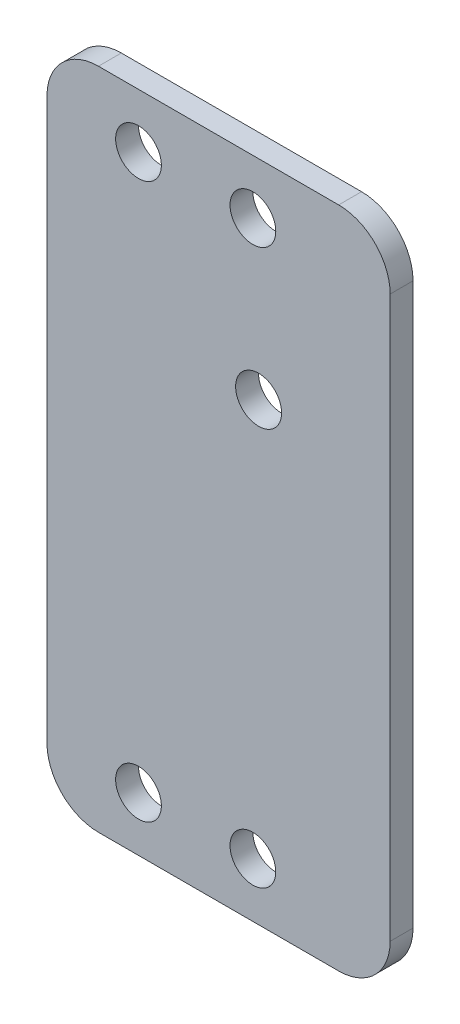
ISO-10303-21;
HEADER;
FILE_DESCRIPTION(('STEP AP214'),'2;1');
FILE_NAME('part.step','',(''),(''),'','','');
FILE_SCHEMA(('AUTOMOTIVE_DESIGN { 1 0 10303 214 1 1 1 1 }'));
ENDSEC;
DATA;
#1=APPLICATION_CONTEXT('core data for automotive mechanical design processes');
#2=APPLICATION_PROTOCOL_DEFINITION('international standard','automotive_design',2000,#1);
#3=PRODUCT_CONTEXT('',#1,'mechanical');
#4=PRODUCT('Part','Part','',(#3));
#5=PRODUCT_RELATED_PRODUCT_CATEGORY('part','',(#4));
#6=PRODUCT_DEFINITION_FORMATION('','',#4);
#7=PRODUCT_DEFINITION_CONTEXT('part definition',#1,'design');
#8=PRODUCT_DEFINITION('design','',#6,#7);
#9=PRODUCT_DEFINITION_SHAPE('','',#8);
#10=(LENGTH_UNIT() NAMED_UNIT(*) SI_UNIT(.MILLI.,.METRE.));
#11=(NAMED_UNIT(*) PLANE_ANGLE_UNIT() SI_UNIT($,.RADIAN.));
#12=(NAMED_UNIT(*) SI_UNIT($,.STERADIAN.) SOLID_ANGLE_UNIT());
#13=UNCERTAINTY_MEASURE_WITH_UNIT(LENGTH_MEASURE(1.E-05),#10,'distance_accuracy_value','');
#14=(GEOMETRIC_REPRESENTATION_CONTEXT(3) GLOBAL_UNCERTAINTY_ASSIGNED_CONTEXT((#13)) GLOBAL_UNIT_ASSIGNED_CONTEXT((#10,
#11,#12)) REPRESENTATION_CONTEXT('',''));
#15=CARTESIAN_POINT('',(0.,0.,0.));
#16=DIRECTION('',(0.,0.,1.));
#17=DIRECTION('',(1.,0.,0.));
#18=AXIS2_PLACEMENT_3D('',#15,#16,#17);
#19=CARTESIAN_POINT('',(0.,0.,-2.));
#20=DIRECTION('',(0.,0.,-1.));
#21=DIRECTION('',(1.,0.,0.));
#22=AXIS2_PLACEMENT_3D('',#19,#20,#21);
#23=PLANE('',#22);
#24=CARTESIAN_POINT('',(3.,-24.25,-2.));
#25=DIRECTION('',(0.,0.,1.));
#26=DIRECTION('',(1.,0.,0.));
#27=AXIS2_PLACEMENT_3D('',#24,#25,#26);
#28=CIRCLE('',#27,2.);
#29=CARTESIAN_POINT('',(5.,-24.25,-2.));
#30=VERTEX_POINT('',#29);
#31=EDGE_CURVE('E196',#30,#30,#28,.T.);
#32=ORIENTED_EDGE('',*,*,#31,.T.);
#33=EDGE_LOOP('',(#32));
#34=FACE_BOUND('',#33,.T.);
#35=CARTESIAN_POINT('',(-7.00000000000001,24.25,-2.));
#36=DIRECTION('',(0.,0.,1.));
#37=DIRECTION('',(1.,0.,0.));
#38=AXIS2_PLACEMENT_3D('',#35,#36,#37);
#39=CIRCLE('',#38,2.);
#40=CARTESIAN_POINT('',(-5.00000000000001,24.25,-2.));
#41=VERTEX_POINT('',#40);
#42=EDGE_CURVE('E185',#41,#41,#39,.T.);
#43=ORIENTED_EDGE('',*,*,#42,.T.);
#44=EDGE_LOOP('',(#43));
#45=FACE_BOUND('',#44,.T.);
#46=DIRECTION('',(1.,0.,0.));
#47=VECTOR('',#46,1.);
#48=CARTESIAN_POINT('',(-15.,-29.,-2.));
#49=LINE('',#48,#47);
#50=CARTESIAN_POINT('',(-10.5,-29.,-2.));
#51=VERTEX_POINT('',#50);
#52=CARTESIAN_POINT('',(10.5,-29.,-2.));
#53=VERTEX_POINT('',#52);
#54=EDGE_CURVE('E168',#51,#53,#49,.T.);
#55=ORIENTED_EDGE('',*,*,#54,.F.);
#56=CARTESIAN_POINT('',(-10.5,-24.5,-2.));
#57=DIRECTION('',(0.,0.,1.));
#58=DIRECTION('',(1.,0.,0.));
#59=AXIS2_PLACEMENT_3D('',#56,#57,#58);
#60=CIRCLE('',#59,4.5);
#61=CARTESIAN_POINT('',(-15.,-24.5,-2.));
#62=VERTEX_POINT('',#61);
#63=EDGE_CURVE('E149',#62,#51,#60,.T.);
#64=ORIENTED_EDGE('',*,*,#63,.F.);
#65=DIRECTION('',(0.,-1.,0.));
#66=VECTOR('',#65,1.);
#67=CARTESIAN_POINT('',(-15.,29.,-2.));
#68=LINE('',#67,#66);
#69=CARTESIAN_POINT('',(-15.,24.5,-2.));
#70=VERTEX_POINT('',#69);
#71=EDGE_CURVE('E129',#70,#62,#68,.T.);
#72=ORIENTED_EDGE('',*,*,#71,.F.);
#73=CARTESIAN_POINT('',(-10.5,24.5,-2.));
#74=DIRECTION('',(0.,0.,1.));
#75=DIRECTION('',(1.,0.,0.));
#76=AXIS2_PLACEMENT_3D('',#73,#74,#75);
#77=CIRCLE('',#76,4.5);
#78=CARTESIAN_POINT('',(-10.5,29.,-2.));
#79=VERTEX_POINT('',#78);
#80=EDGE_CURVE('E145',#79,#70,#77,.T.);
#81=ORIENTED_EDGE('',*,*,#80,.F.);
#82=DIRECTION('',(-1.,0.,0.));
#83=VECTOR('',#82,1.);
#84=CARTESIAN_POINT('',(-15.,29.,-2.));
#85=LINE('',#84,#83);
#86=CARTESIAN_POINT('',(10.5,29.,-2.));
#87=VERTEX_POINT('',#86);
#88=EDGE_CURVE('E135',#87,#79,#85,.T.);
#89=ORIENTED_EDGE('',*,*,#88,.F.);
#90=CARTESIAN_POINT('',(10.5,24.5,-2.));
#91=DIRECTION('',(0.,0.,1.));
#92=DIRECTION('',(1.,0.,0.));
#93=AXIS2_PLACEMENT_3D('',#90,#91,#92);
#94=CIRCLE('',#93,4.5);
#95=CARTESIAN_POINT('',(15.,24.5,-2.));
#96=VERTEX_POINT('',#95);
#97=EDGE_CURVE('E147',#96,#87,#94,.T.);
#98=ORIENTED_EDGE('',*,*,#97,.F.);
#99=DIRECTION('',(0.,1.,0.));
#100=VECTOR('',#99,1.);
#101=CARTESIAN_POINT('',(15.,29.,-2.));
#102=LINE('',#101,#100);
#103=CARTESIAN_POINT('',(15.,-24.5,-2.));
#104=VERTEX_POINT('',#103);
#105=EDGE_CURVE('E173',#104,#96,#102,.T.);
#106=ORIENTED_EDGE('',*,*,#105,.F.);
#107=CARTESIAN_POINT('',(10.5,-24.5,-2.));
#108=DIRECTION('',(0.,0.,1.));
#109=DIRECTION('',(1.,0.,0.));
#110=AXIS2_PLACEMENT_3D('',#107,#108,#109);
#111=CIRCLE('',#110,4.5);
#112=EDGE_CURVE('E104',#53,#104,#111,.T.);
#113=ORIENTED_EDGE('',*,*,#112,.F.);
#114=EDGE_LOOP('',(#55,#64,#72,#81,#89,#98,#106,#113));
#115=FACE_BOUND('',#114,.T.);
#116=CARTESIAN_POINT('',(2.99999999999999,24.25,-2.));
#117=DIRECTION('',(0.,0.,1.));
#118=DIRECTION('',(1.,0.,0.));
#119=AXIS2_PLACEMENT_3D('',#116,#117,#118);
#120=CIRCLE('',#119,2.);
#121=CARTESIAN_POINT('',(4.99999999999999,24.25,-2.));
#122=VERTEX_POINT('',#121);
#123=EDGE_CURVE('E178',#122,#122,#120,.T.);
#124=ORIENTED_EDGE('',*,*,#123,.T.);
#125=EDGE_LOOP('',(#124));
#126=FACE_BOUND('',#125,.T.);
#127=CARTESIAN_POINT('',(-7.,-24.25,-2.));
#128=DIRECTION('',(0.,0.,1.));
#129=DIRECTION('',(1.,0.,0.));
#130=AXIS2_PLACEMENT_3D('',#127,#128,#129);
#131=CIRCLE('',#130,2.);
#132=CARTESIAN_POINT('',(-5.,-24.25,-2.));
#133=VERTEX_POINT('',#132);
#134=EDGE_CURVE('E190',#133,#133,#131,.T.);
#135=ORIENTED_EDGE('',*,*,#134,.T.);
#136=EDGE_LOOP('',(#135));
#137=FACE_BOUND('',#136,.T.);
#138=CARTESIAN_POINT('',(3.5,10.75,-2.));
#139=DIRECTION('',(0.,0.,1.));
#140=DIRECTION('',(1.,0.,0.));
#141=AXIS2_PLACEMENT_3D('',#138,#139,#140);
#142=CIRCLE('',#141,2.01);
#143=CARTESIAN_POINT('',(5.51,10.75,-2.));
#144=VERTEX_POINT('',#143);
#145=EDGE_CURVE('E202',#144,#144,#142,.T.);
#146=ORIENTED_EDGE('',*,*,#145,.T.);
#147=EDGE_LOOP('',(#146));
#148=FACE_BOUND('',#147,.T.);
#149=ADVANCED_FACE('F35',(#34,#45,#115,#126,#137,#148),#23,.T.);
#150=CARTESIAN_POINT('',(0.,0.,0.));
#151=DIRECTION('',(0.,0.,-1.));
#152=DIRECTION('',(1.,0.,0.));
#153=AXIS2_PLACEMENT_3D('',#150,#151,#152);
#154=PLANE('',#153);
#155=DIRECTION('',(0.,1.,0.));
#156=VECTOR('',#155,1.);
#157=CARTESIAN_POINT('',(15.,29.,0.));
#158=LINE('',#157,#156);
#159=CARTESIAN_POINT('',(15.,-24.5,0.));
#160=VERTEX_POINT('',#159);
#161=CARTESIAN_POINT('',(15.,24.5,0.));
#162=VERTEX_POINT('',#161);
#163=EDGE_CURVE('E117',#160,#162,#158,.T.);
#164=ORIENTED_EDGE('',*,*,#163,.T.);
#165=CARTESIAN_POINT('',(10.5,24.5,0.));
#166=DIRECTION('',(0.,0.,1.));
#167=DIRECTION('',(1.,0.,0.));
#168=AXIS2_PLACEMENT_3D('',#165,#166,#167);
#169=CIRCLE('',#168,4.5);
#170=CARTESIAN_POINT('',(10.5,29.,0.));
#171=VERTEX_POINT('',#170);
#172=EDGE_CURVE('E138',#171,#162,#169,.F.);
#173=ORIENTED_EDGE('',*,*,#172,.F.);
#174=DIRECTION('',(-1.,0.,0.));
#175=VECTOR('',#174,1.);
#176=CARTESIAN_POINT('',(-15.,29.,0.));
#177=LINE('',#176,#175);
#178=CARTESIAN_POINT('',(-10.5,29.,0.));
#179=VERTEX_POINT('',#178);
#180=EDGE_CURVE('E126',#171,#179,#177,.T.);
#181=ORIENTED_EDGE('',*,*,#180,.T.);
#182=CARTESIAN_POINT('',(-10.5,24.5,0.));
#183=DIRECTION('',(0.,0.,1.));
#184=DIRECTION('',(1.,0.,0.));
#185=AXIS2_PLACEMENT_3D('',#182,#183,#184);
#186=CIRCLE('',#185,4.5);
#187=CARTESIAN_POINT('',(-15.,24.5,0.));
#188=VERTEX_POINT('',#187);
#189=EDGE_CURVE('E109',#188,#179,#186,.F.);
#190=ORIENTED_EDGE('',*,*,#189,.F.);
#191=DIRECTION('',(0.,-1.,0.));
#192=VECTOR('',#191,1.);
#193=CARTESIAN_POINT('',(-15.,29.,0.));
#194=LINE('',#193,#192);
#195=CARTESIAN_POINT('',(-15.,-24.5,0.));
#196=VERTEX_POINT('',#195);
#197=EDGE_CURVE('E131',#188,#196,#194,.T.);
#198=ORIENTED_EDGE('',*,*,#197,.T.);
#199=CARTESIAN_POINT('',(-10.5,-24.5,0.));
#200=DIRECTION('',(0.,0.,1.));
#201=DIRECTION('',(1.,0.,0.));
#202=AXIS2_PLACEMENT_3D('',#199,#200,#201);
#203=CIRCLE('',#202,4.5);
#204=CARTESIAN_POINT('',(-10.5,-29.,0.));
#205=VERTEX_POINT('',#204);
#206=EDGE_CURVE('E122',#205,#196,#203,.F.);
#207=ORIENTED_EDGE('',*,*,#206,.F.);
#208=DIRECTION('',(1.,0.,0.));
#209=VECTOR('',#208,1.);
#210=CARTESIAN_POINT('',(-15.,-29.,0.));
#211=LINE('',#210,#209);
#212=CARTESIAN_POINT('',(10.5,-29.,0.));
#213=VERTEX_POINT('',#212);
#214=EDGE_CURVE('E120',#205,#213,#211,.T.);
#215=ORIENTED_EDGE('',*,*,#214,.T.);
#216=CARTESIAN_POINT('',(10.5,-24.5,0.));
#217=DIRECTION('',(0.,0.,1.));
#218=DIRECTION('',(1.,0.,0.));
#219=AXIS2_PLACEMENT_3D('',#216,#217,#218);
#220=CIRCLE('',#219,4.5);
#221=EDGE_CURVE('E101',#160,#213,#220,.F.);
#222=ORIENTED_EDGE('',*,*,#221,.F.);
#223=EDGE_LOOP('',(#164,#173,#181,#190,#198,#207,#215,#222));
#224=FACE_BOUND('',#223,.T.);
#225=CARTESIAN_POINT('',(2.99999999999999,24.25,0.));
#226=DIRECTION('',(0.,0.,1.));
#227=DIRECTION('',(1.,0.,0.));
#228=AXIS2_PLACEMENT_3D('',#225,#226,#227);
#229=CIRCLE('',#228,2.);
#230=CARTESIAN_POINT('',(4.99999999999999,24.25,0.));
#231=VERTEX_POINT('',#230);
#232=EDGE_CURVE('E181',#231,#231,#229,.T.);
#233=ORIENTED_EDGE('',*,*,#232,.F.);
#234=EDGE_LOOP('',(#233));
#235=FACE_BOUND('',#234,.T.);
#236=CARTESIAN_POINT('',(-7.00000000000001,24.25,0.));
#237=DIRECTION('',(0.,0.,1.));
#238=DIRECTION('',(1.,0.,0.));
#239=AXIS2_PLACEMENT_3D('',#236,#237,#238);
#240=CIRCLE('',#239,2.);
#241=CARTESIAN_POINT('',(-5.00000000000001,24.25,0.));
#242=VERTEX_POINT('',#241);
#243=EDGE_CURVE('E187',#242,#242,#240,.T.);
#244=ORIENTED_EDGE('',*,*,#243,.F.);
#245=EDGE_LOOP('',(#244));
#246=FACE_BOUND('',#245,.T.);
#247=CARTESIAN_POINT('',(-7.,-24.25,0.));
#248=DIRECTION('',(0.,0.,1.));
#249=DIRECTION('',(1.,0.,0.));
#250=AXIS2_PLACEMENT_3D('',#247,#248,#249);
#251=CIRCLE('',#250,2.);
#252=CARTESIAN_POINT('',(-5.,-24.25,0.));
#253=VERTEX_POINT('',#252);
#254=EDGE_CURVE('E193',#253,#253,#251,.T.);
#255=ORIENTED_EDGE('',*,*,#254,.F.);
#256=EDGE_LOOP('',(#255));
#257=FACE_BOUND('',#256,.T.);
#258=CARTESIAN_POINT('',(3.,-24.25,0.));
#259=DIRECTION('',(0.,0.,1.));
#260=DIRECTION('',(1.,0.,0.));
#261=AXIS2_PLACEMENT_3D('',#258,#259,#260);
#262=CIRCLE('',#261,2.);
#263=CARTESIAN_POINT('',(5.,-24.25,0.));
#264=VERTEX_POINT('',#263);
#265=EDGE_CURVE('E199',#264,#264,#262,.T.);
#266=ORIENTED_EDGE('',*,*,#265,.F.);
#267=EDGE_LOOP('',(#266));
#268=FACE_BOUND('',#267,.T.);
#269=CARTESIAN_POINT('',(3.5,10.75,0.));
#270=DIRECTION('',(0.,0.,1.));
#271=DIRECTION('',(1.,0.,0.));
#272=AXIS2_PLACEMENT_3D('',#269,#270,#271);
#273=CIRCLE('',#272,2.01);
#274=CARTESIAN_POINT('',(5.51,10.75,0.));
#275=VERTEX_POINT('',#274);
#276=EDGE_CURVE('E205',#275,#275,#273,.T.);
#277=ORIENTED_EDGE('',*,*,#276,.F.);
#278=EDGE_LOOP('',(#277));
#279=FACE_BOUND('',#278,.T.);
#280=ADVANCED_FACE('F114',(#224,#235,#246,#257,#268,#279),#154,.F.);
#281=CARTESIAN_POINT('',(-15.,29.,-2.));
#282=DIRECTION('',(1.,0.,0.));
#283=DIRECTION('',(0.,0.,1.));
#284=AXIS2_PLACEMENT_3D('',#281,#282,#283);
#285=PLANE('',#284);
#286=ORIENTED_EDGE('',*,*,#197,.F.);
#287=DIRECTION('',(0.,0.,1.));
#288=VECTOR('',#287,1.);
#289=CARTESIAN_POINT('',(-15.,24.5,-2.));
#290=LINE('',#289,#288);
#291=EDGE_CURVE('E153',#70,#188,#290,.T.);
#292=ORIENTED_EDGE('',*,*,#291,.F.);
#293=ORIENTED_EDGE('',*,*,#71,.T.);
#294=DIRECTION('',(0.,0.,1.));
#295=VECTOR('',#294,1.);
#296=CARTESIAN_POINT('',(-15.,-24.5,-2.));
#297=LINE('',#296,#295);
#298=EDGE_CURVE('E155',#196,#62,#297,.F.);
#299=ORIENTED_EDGE('',*,*,#298,.F.);
#300=EDGE_LOOP('',(#286,#292,#293,#299));
#301=FACE_BOUND('',#300,.T.);
#302=ADVANCED_FACE('F165',(#301),#285,.F.);
#303=CARTESIAN_POINT('',(-15.,-29.,-2.));
#304=DIRECTION('',(0.,1.,0.));
#305=DIRECTION('',(0.,0.,-1.));
#306=AXIS2_PLACEMENT_3D('',#303,#304,#305);
#307=PLANE('',#306);
#308=ORIENTED_EDGE('',*,*,#214,.F.);
#309=DIRECTION('',(0.,0.,1.));
#310=VECTOR('',#309,1.);
#311=CARTESIAN_POINT('',(-10.5,-29.,-2.));
#312=LINE('',#311,#310);
#313=EDGE_CURVE('E121',#51,#205,#312,.T.);
#314=ORIENTED_EDGE('',*,*,#313,.F.);
#315=ORIENTED_EDGE('',*,*,#54,.T.);
#316=DIRECTION('',(0.,0.,1.));
#317=VECTOR('',#316,1.);
#318=CARTESIAN_POINT('',(10.5,-29.,-2.));
#319=LINE('',#318,#317);
#320=EDGE_CURVE('E143',#213,#53,#319,.F.);
#321=ORIENTED_EDGE('',*,*,#320,.F.);
#322=EDGE_LOOP('',(#308,#314,#315,#321));
#323=FACE_BOUND('',#322,.T.);
#324=ADVANCED_FACE('F225',(#323),#307,.F.);
#325=CARTESIAN_POINT('',(15.,29.,-2.));
#326=DIRECTION('',(-1.,0.,0.));
#327=DIRECTION('',(0.,0.,-1.));
#328=AXIS2_PLACEMENT_3D('',#325,#326,#327);
#329=PLANE('',#328);
#330=ORIENTED_EDGE('',*,*,#105,.T.);
#331=DIRECTION('',(0.,0.,1.));
#332=VECTOR('',#331,1.);
#333=CARTESIAN_POINT('',(15.,24.5,-2.));
#334=LINE('',#333,#332);
#335=EDGE_CURVE('E110',#162,#96,#334,.F.);
#336=ORIENTED_EDGE('',*,*,#335,.F.);
#337=ORIENTED_EDGE('',*,*,#163,.F.);
#338=DIRECTION('',(0.,0.,1.));
#339=VECTOR('',#338,1.);
#340=CARTESIAN_POINT('',(15.,-24.5,-2.));
#341=LINE('',#340,#339);
#342=EDGE_CURVE('E98',#104,#160,#341,.T.);
#343=ORIENTED_EDGE('',*,*,#342,.F.);
#344=EDGE_LOOP('',(#330,#336,#337,#343));
#345=FACE_BOUND('',#344,.T.);
#346=ADVANCED_FACE('F124',(#345),#329,.F.);
#347=CARTESIAN_POINT('',(-15.,29.,-2.));
#348=DIRECTION('',(0.,-1.,0.));
#349=DIRECTION('',(0.,0.,1.));
#350=AXIS2_PLACEMENT_3D('',#347,#348,#349);
#351=PLANE('',#350);
#352=ORIENTED_EDGE('',*,*,#88,.T.);
#353=DIRECTION('',(0.,0.,1.));
#354=VECTOR('',#353,1.);
#355=CARTESIAN_POINT('',(-10.5,29.,-2.));
#356=LINE('',#355,#354);
#357=EDGE_CURVE('E43',#179,#79,#356,.F.);
#358=ORIENTED_EDGE('',*,*,#357,.F.);
#359=ORIENTED_EDGE('',*,*,#180,.F.);
#360=DIRECTION('',(0.,0.,1.));
#361=VECTOR('',#360,1.);
#362=CARTESIAN_POINT('',(10.5,29.,-2.));
#363=LINE('',#362,#361);
#364=EDGE_CURVE('E11',#87,#171,#363,.T.);
#365=ORIENTED_EDGE('',*,*,#364,.F.);
#366=EDGE_LOOP('',(#352,#358,#359,#365));
#367=FACE_BOUND('',#366,.T.);
#368=ADVANCED_FACE('F231',(#367),#351,.F.);
#369=CARTESIAN_POINT('',(2.99999999999999,24.25,-2.));
#370=DIRECTION('',(0.,0.,1.));
#371=DIRECTION('',(-1.,0.,0.));
#372=AXIS2_PLACEMENT_3D('',#369,#370,#371);
#373=CYLINDRICAL_SURFACE('',#372,2.);
#374=ORIENTED_EDGE('',*,*,#123,.F.);
#375=EDGE_LOOP('',(#374));
#376=FACE_BOUND('',#375,.T.);
#377=ORIENTED_EDGE('',*,*,#232,.T.);
#378=EDGE_LOOP('',(#377));
#379=FACE_BOUND('',#378,.T.);
#380=ADVANCED_FACE('F234',(#376,#379),#373,.F.);
#381=CARTESIAN_POINT('',(-7.00000000000001,24.25,-2.));
#382=DIRECTION('',(0.,0.,1.));
#383=DIRECTION('',(-1.,0.,0.));
#384=AXIS2_PLACEMENT_3D('',#381,#382,#383);
#385=CYLINDRICAL_SURFACE('',#384,2.);
#386=ORIENTED_EDGE('',*,*,#42,.F.);
#387=EDGE_LOOP('',(#386));
#388=FACE_BOUND('',#387,.T.);
#389=ORIENTED_EDGE('',*,*,#243,.T.);
#390=EDGE_LOOP('',(#389));
#391=FACE_BOUND('',#390,.T.);
#392=ADVANCED_FACE('F293',(#388,#391),#385,.F.);
#393=CARTESIAN_POINT('',(-7.,-24.25,-2.));
#394=DIRECTION('',(0.,0.,1.));
#395=DIRECTION('',(-1.,0.,0.));
#396=AXIS2_PLACEMENT_3D('',#393,#394,#395);
#397=CYLINDRICAL_SURFACE('',#396,2.);
#398=ORIENTED_EDGE('',*,*,#134,.F.);
#399=EDGE_LOOP('',(#398));
#400=FACE_BOUND('',#399,.T.);
#401=ORIENTED_EDGE('',*,*,#254,.T.);
#402=EDGE_LOOP('',(#401));
#403=FACE_BOUND('',#402,.T.);
#404=ADVANCED_FACE('F283',(#400,#403),#397,.F.);
#405=CARTESIAN_POINT('',(3.,-24.25,-2.));
#406=DIRECTION('',(0.,0.,1.));
#407=DIRECTION('',(-1.,0.,0.));
#408=AXIS2_PLACEMENT_3D('',#405,#406,#407);
#409=CYLINDRICAL_SURFACE('',#408,2.);
#410=ORIENTED_EDGE('',*,*,#31,.F.);
#411=EDGE_LOOP('',(#410));
#412=FACE_BOUND('',#411,.T.);
#413=ORIENTED_EDGE('',*,*,#265,.T.);
#414=EDGE_LOOP('',(#413));
#415=FACE_BOUND('',#414,.T.);
#416=ADVANCED_FACE('F215',(#412,#415),#409,.F.);
#417=CARTESIAN_POINT('',(3.5,10.75,-2.));
#418=DIRECTION('',(0.,0.,1.));
#419=DIRECTION('',(-1.,0.,0.));
#420=AXIS2_PLACEMENT_3D('',#417,#418,#419);
#421=CYLINDRICAL_SURFACE('',#420,2.01);
#422=ORIENTED_EDGE('',*,*,#145,.F.);
#423=EDGE_LOOP('',(#422));
#424=FACE_BOUND('',#423,.T.);
#425=ORIENTED_EDGE('',*,*,#276,.T.);
#426=EDGE_LOOP('',(#425));
#427=FACE_BOUND('',#426,.T.);
#428=ADVANCED_FACE('F212',(#424,#427),#421,.F.);
#429=CARTESIAN_POINT('',(10.5,-24.5,-2.));
#430=DIRECTION('',(0.,0.,1.));
#431=DIRECTION('',(-1.,0.,0.));
#432=AXIS2_PLACEMENT_3D('',#429,#430,#431);
#433=CYLINDRICAL_SURFACE('',#432,4.5);
#434=ORIENTED_EDGE('',*,*,#112,.T.);
#435=ORIENTED_EDGE('',*,*,#342,.T.);
#436=ORIENTED_EDGE('',*,*,#221,.T.);
#437=ORIENTED_EDGE('',*,*,#320,.T.);
#438=EDGE_LOOP('',(#434,#435,#436,#437));
#439=FACE_BOUND('',#438,.T.);
#440=ADVANCED_FACE('F100',(#439),#433,.T.);
#441=CARTESIAN_POINT('',(-10.5,-24.5,-2.));
#442=DIRECTION('',(0.,0.,1.));
#443=DIRECTION('',(-1.,0.,0.));
#444=AXIS2_PLACEMENT_3D('',#441,#442,#443);
#445=CYLINDRICAL_SURFACE('',#444,4.5);
#446=ORIENTED_EDGE('',*,*,#63,.T.);
#447=ORIENTED_EDGE('',*,*,#313,.T.);
#448=ORIENTED_EDGE('',*,*,#206,.T.);
#449=ORIENTED_EDGE('',*,*,#298,.T.);
#450=EDGE_LOOP('',(#446,#447,#448,#449));
#451=FACE_BOUND('',#450,.T.);
#452=ADVANCED_FACE('F158',(#451),#445,.T.);
#453=CARTESIAN_POINT('',(10.5,24.5,-2.));
#454=DIRECTION('',(0.,0.,1.));
#455=DIRECTION('',(-1.,0.,0.));
#456=AXIS2_PLACEMENT_3D('',#453,#454,#455);
#457=CYLINDRICAL_SURFACE('',#456,4.5);
#458=ORIENTED_EDGE('',*,*,#97,.T.);
#459=ORIENTED_EDGE('',*,*,#364,.T.);
#460=ORIENTED_EDGE('',*,*,#172,.T.);
#461=ORIENTED_EDGE('',*,*,#335,.T.);
#462=EDGE_LOOP('',(#458,#459,#460,#461));
#463=FACE_BOUND('',#462,.T.);
#464=ADVANCED_FACE('F242',(#463),#457,.T.);
#465=CARTESIAN_POINT('',(-10.5,24.5,-2.));
#466=DIRECTION('',(0.,0.,1.));
#467=DIRECTION('',(-1.,0.,0.));
#468=AXIS2_PLACEMENT_3D('',#465,#466,#467);
#469=CYLINDRICAL_SURFACE('',#468,4.5);
#470=ORIENTED_EDGE('',*,*,#80,.T.);
#471=ORIENTED_EDGE('',*,*,#291,.T.);
#472=ORIENTED_EDGE('',*,*,#189,.T.);
#473=ORIENTED_EDGE('',*,*,#357,.T.);
#474=EDGE_LOOP('',(#470,#471,#472,#473));
#475=FACE_BOUND('',#474,.T.);
#476=ADVANCED_FACE('F37',(#475),#469,.T.);
#477=CLOSED_SHELL('',(#149,#280,#302,#324,#346,#368,#380,#392,#404,#416,#428,#440,#452,#464,#476));
#478=MANIFOLD_SOLID_BREP('B2',#477);
#479=ADVANCED_BREP_SHAPE_REPRESENTATION('',(#18,#478),#14);
#480=SHAPE_DEFINITION_REPRESENTATION(#9,#479);
ENDSEC;
END-ISO-10303-21;
